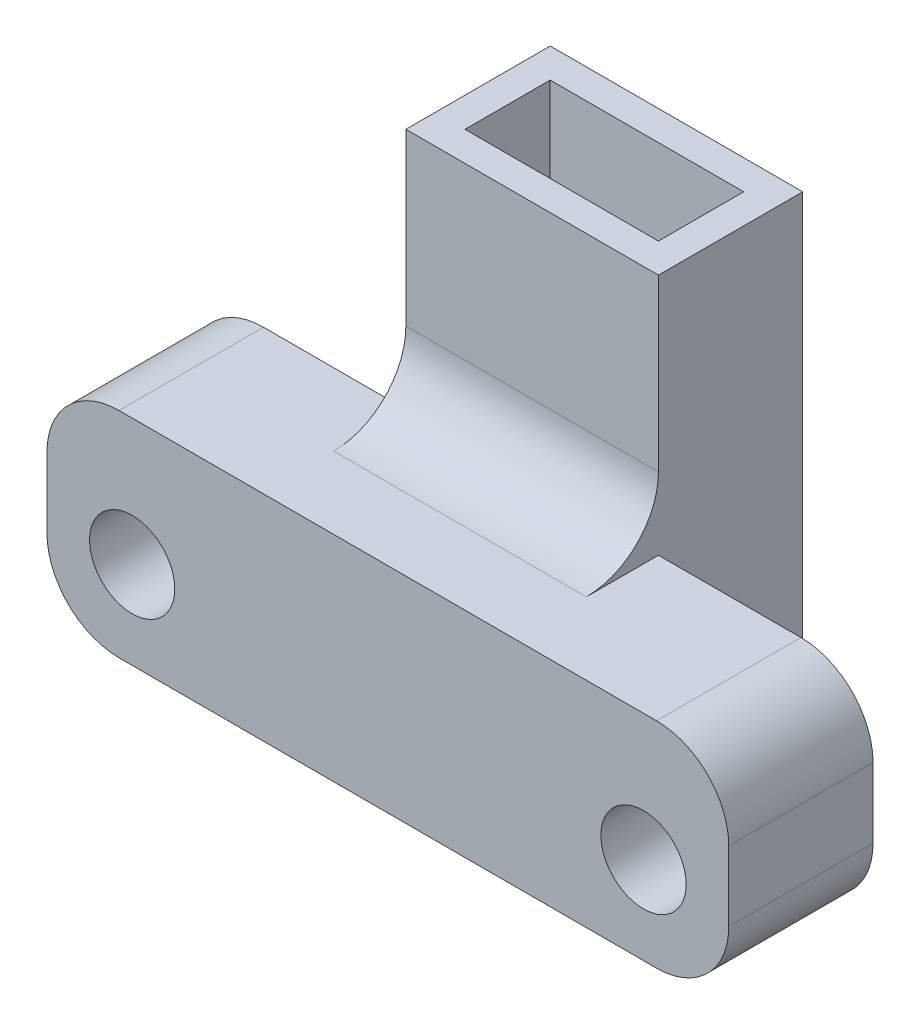
ISO-10303-21;
HEADER;
FILE_DESCRIPTION(('STEP AP214'),'2;1');
FILE_NAME('part.step','',(''),(''),'','','');
FILE_SCHEMA(('AUTOMOTIVE_DESIGN { 1 0 10303 214 1 1 1 1 }'));
ENDSEC;
DATA;
#1=APPLICATION_CONTEXT('core data for automotive mechanical design processes');
#2=APPLICATION_PROTOCOL_DEFINITION('international standard','automotive_design',2000,#1);
#3=PRODUCT_CONTEXT('',#1,'mechanical');
#4=PRODUCT('Part','Part','',(#3));
#5=PRODUCT_RELATED_PRODUCT_CATEGORY('part','',(#4));
#6=PRODUCT_DEFINITION_FORMATION('','',#4);
#7=PRODUCT_DEFINITION_CONTEXT('part definition',#1,'design');
#8=PRODUCT_DEFINITION('design','',#6,#7);
#9=PRODUCT_DEFINITION_SHAPE('','',#8);
#10=(LENGTH_UNIT() NAMED_UNIT(*) SI_UNIT(.MILLI.,.METRE.));
#11=(NAMED_UNIT(*) PLANE_ANGLE_UNIT() SI_UNIT($,.RADIAN.));
#12=(NAMED_UNIT(*) SI_UNIT($,.STERADIAN.) SOLID_ANGLE_UNIT());
#13=UNCERTAINTY_MEASURE_WITH_UNIT(LENGTH_MEASURE(1.E-05),#10,'distance_accuracy_value','');
#14=(GEOMETRIC_REPRESENTATION_CONTEXT(3) GLOBAL_UNCERTAINTY_ASSIGNED_CONTEXT((#13)) GLOBAL_UNIT_ASSIGNED_CONTEXT((#10,
#11,#12)) REPRESENTATION_CONTEXT('',''));
#15=CARTESIAN_POINT('',(0.,0.,0.));
#16=DIRECTION('',(0.,0.,1.));
#17=DIRECTION('',(1.,0.,0.));
#18=AXIS2_PLACEMENT_3D('',#15,#16,#17);
#19=CARTESIAN_POINT('',(-4.445,16.08,2.54));
#20=DIRECTION('',(0.,0.,-1.));
#21=DIRECTION('',(-1.,0.,0.));
#22=AXIS2_PLACEMENT_3D('',#19,#20,#21);
#23=PLANE('',#22);
#24=DIRECTION('',(0.,-1.,0.));
#25=VECTOR('',#24,1.);
#26=CARTESIAN_POINT('',(-4.445,16.08,2.54));
#27=LINE('',#26,#25);
#28=CARTESIAN_POINT('',(-4.445,16.08,2.54));
#29=VERTEX_POINT('',#28);
#30=CARTESIAN_POINT('',(-4.445,10.0805167244017,2.54));
#31=VERTEX_POINT('',#30);
#32=EDGE_CURVE('E282',#29,#31,#27,.T.);
#33=ORIENTED_EDGE('',*,*,#32,.T.);
#34=DIRECTION('',(-1.,0.,0.));
#35=VECTOR('',#34,1.);
#36=CARTESIAN_POINT('',(4.445,10.0805167244017,2.54));
#37=LINE('',#36,#35);
#38=CARTESIAN_POINT('',(4.445,10.0805167244017,2.54));
#39=VERTEX_POINT('',#38);
#40=EDGE_CURVE('E274',#31,#39,#37,.F.);
#41=ORIENTED_EDGE('',*,*,#40,.T.);
#42=DIRECTION('',(0.,-1.,0.));
#43=VECTOR('',#42,1.);
#44=CARTESIAN_POINT('',(4.445,16.08,2.54));
#45=LINE('',#44,#43);
#46=CARTESIAN_POINT('',(4.445,16.08,2.54));
#47=VERTEX_POINT('',#46);
#48=EDGE_CURVE('E280',#47,#39,#45,.T.);
#49=ORIENTED_EDGE('',*,*,#48,.F.);
#50=DIRECTION('',(1.,0.,0.));
#51=VECTOR('',#50,1.);
#52=CARTESIAN_POINT('',(-4.445,16.08,2.54));
#53=LINE('',#52,#51);
#54=EDGE_CURVE('E309',#29,#47,#53,.T.);
#55=ORIENTED_EDGE('',*,*,#54,.F.);
#56=EDGE_LOOP('',(#33,#41,#49,#55));
#57=FACE_BOUND('',#56,.T.);
#58=ADVANCED_FACE('F33',(#57),#23,.F.);
#59=CARTESIAN_POINT('',(4.445,16.08,2.54));
#60=DIRECTION('',(-1.,0.,0.));
#61=DIRECTION('',(0.,0.,1.));
#62=AXIS2_PLACEMENT_3D('',#59,#60,#61);
#63=PLANE('',#62);
#64=DIRECTION('',(0.,0.,-1.));
#65=VECTOR('',#64,1.);
#66=CARTESIAN_POINT('',(4.445,0.,2.54));
#67=LINE('',#66,#65);
#68=CARTESIAN_POINT('',(4.445,0.,2.54));
#69=VERTEX_POINT('',#68);
#70=CARTESIAN_POINT('',(4.445,0.,-2.54));
#71=VERTEX_POINT('',#70);
#72=EDGE_CURVE('E222',#69,#71,#67,.T.);
#73=ORIENTED_EDGE('',*,*,#72,.T.);
#74=DIRECTION('',(0.,-1.,0.));
#75=VECTOR('',#74,1.);
#76=CARTESIAN_POINT('',(4.445,16.08,-2.54));
#77=LINE('',#76,#75);
#78=CARTESIAN_POINT('',(4.445,16.08,-2.54));
#79=VERTEX_POINT('',#78);
#80=EDGE_CURVE('E315',#79,#71,#77,.T.);
#81=ORIENTED_EDGE('',*,*,#80,.F.);
#82=DIRECTION('',(0.,0.,-1.));
#83=VECTOR('',#82,1.);
#84=CARTESIAN_POINT('',(4.445,16.08,2.54));
#85=LINE('',#84,#83);
#86=EDGE_CURVE('E289',#47,#79,#85,.T.);
#87=ORIENTED_EDGE('',*,*,#86,.F.);
#88=ORIENTED_EDGE('',*,*,#48,.T.);
#89=CARTESIAN_POINT('',(4.445,10.0805167244017,5.08));
#90=DIRECTION('',(-1.,0.,0.));
#91=DIRECTION('',(0.,0.,1.));
#92=AXIS2_PLACEMENT_3D('',#89,#90,#91);
#93=CIRCLE('',#92,2.54);
#94=CARTESIAN_POINT('',(4.445,7.54051672440169,5.08));
#95=VERTEX_POINT('',#94);
#96=EDGE_CURVE('E11',#39,#95,#93,.T.);
#97=ORIENTED_EDGE('',*,*,#96,.T.);
#98=DIRECTION('',(0.,0.,1.));
#99=VECTOR('',#98,1.);
#100=CARTESIAN_POINT('',(4.445,7.54051672440169,2.54));
#101=LINE('',#100,#99);
#102=CARTESIAN_POINT('',(4.445,7.54051672440169,2.54));
#103=VERTEX_POINT('',#102);
#104=EDGE_CURVE('E47',#103,#95,#101,.T.);
#105=ORIENTED_EDGE('',*,*,#104,.F.);
#106=EDGE_CURVE('E291',#103,#69,#45,.T.);
#107=ORIENTED_EDGE('',*,*,#106,.T.);
#108=EDGE_LOOP('',(#73,#81,#87,#88,#97,#105,#107));
#109=FACE_BOUND('',#108,.T.);
#110=ADVANCED_FACE('F286',(#109),#63,.F.);
#111=CARTESIAN_POINT('',(-4.445,16.08,-2.54));
#112=DIRECTION('',(0.,0.,1.));
#113=DIRECTION('',(1.,0.,0.));
#114=AXIS2_PLACEMENT_3D('',#111,#112,#113);
#115=PLANE('',#114);
#116=DIRECTION('',(-1.,0.,0.));
#117=VECTOR('',#116,1.);
#118=CARTESIAN_POINT('',(-4.445,0.,-2.54));
#119=LINE('',#118,#117);
#120=CARTESIAN_POINT('',(-4.445,0.,-2.54));
#121=VERTEX_POINT('',#120);
#122=EDGE_CURVE('E321',#71,#121,#119,.T.);
#123=ORIENTED_EDGE('',*,*,#122,.T.);
#124=DIRECTION('',(0.,-1.,0.));
#125=VECTOR('',#124,1.);
#126=CARTESIAN_POINT('',(-4.445,16.08,-2.54));
#127=LINE('',#126,#125);
#128=CARTESIAN_POINT('',(-4.445,16.08,-2.54));
#129=VERTEX_POINT('',#128);
#130=EDGE_CURVE('E323',#129,#121,#127,.T.);
#131=ORIENTED_EDGE('',*,*,#130,.F.);
#132=DIRECTION('',(-1.,0.,0.));
#133=VECTOR('',#132,1.);
#134=CARTESIAN_POINT('',(-4.445,16.08,-2.54));
#135=LINE('',#134,#133);
#136=EDGE_CURVE('E390',#79,#129,#135,.T.);
#137=ORIENTED_EDGE('',*,*,#136,.F.);
#138=ORIENTED_EDGE('',*,*,#80,.T.);
#139=EDGE_LOOP('',(#123,#131,#137,#138));
#140=FACE_BOUND('',#139,.T.);
#141=ADVANCED_FACE('F389',(#140),#115,.F.);
#142=CARTESIAN_POINT('',(-4.445,16.08,2.54));
#143=DIRECTION('',(1.,0.,0.));
#144=DIRECTION('',(0.,0.,-1.));
#145=AXIS2_PLACEMENT_3D('',#142,#143,#144);
#146=PLANE('',#145);
#147=DIRECTION('',(0.,0.,1.));
#148=VECTOR('',#147,1.);
#149=CARTESIAN_POINT('',(-4.445,0.,2.54));
#150=LINE('',#149,#148);
#151=CARTESIAN_POINT('',(-4.445,0.,2.54));
#152=VERTEX_POINT('',#151);
#153=EDGE_CURVE('E328',#121,#152,#150,.T.);
#154=ORIENTED_EDGE('',*,*,#153,.T.);
#155=CARTESIAN_POINT('',(-4.445,7.54051672440169,2.54));
#156=VERTEX_POINT('',#155);
#157=EDGE_CURVE('E290',#156,#152,#27,.T.);
#158=ORIENTED_EDGE('',*,*,#157,.F.);
#159=DIRECTION('',(0.,0.,-1.));
#160=VECTOR('',#159,1.);
#161=CARTESIAN_POINT('',(-4.445,7.54051672440169,2.54));
#162=LINE('',#161,#160);
#163=CARTESIAN_POINT('',(-4.445,7.54051672440169,5.08));
#164=VERTEX_POINT('',#163);
#165=EDGE_CURVE('E272',#164,#156,#162,.T.);
#166=ORIENTED_EDGE('',*,*,#165,.F.);
#167=CARTESIAN_POINT('',(-4.445,10.0805167244017,5.08));
#168=DIRECTION('',(1.,0.,0.));
#169=DIRECTION('',(0.,0.,-1.));
#170=AXIS2_PLACEMENT_3D('',#167,#168,#169);
#171=CIRCLE('',#170,2.54);
#172=EDGE_CURVE('E41',#164,#31,#171,.T.);
#173=ORIENTED_EDGE('',*,*,#172,.T.);
#174=ORIENTED_EDGE('',*,*,#32,.F.);
#175=DIRECTION('',(0.,0.,1.));
#176=VECTOR('',#175,1.);
#177=CARTESIAN_POINT('',(-4.445,16.08,2.54));
#178=LINE('',#177,#176);
#179=EDGE_CURVE('E311',#129,#29,#178,.T.);
#180=ORIENTED_EDGE('',*,*,#179,.F.);
#181=ORIENTED_EDGE('',*,*,#130,.T.);
#182=EDGE_LOOP('',(#154,#158,#166,#173,#174,#180,#181));
#183=FACE_BOUND('',#182,.T.);
#184=ADVANCED_FACE('F383',(#183),#146,.F.);
#185=CARTESIAN_POINT('',(0.,16.08,0.));
#186=DIRECTION('',(0.,-1.,0.));
#187=DIRECTION('',(0.,0.,-1.));
#188=AXIS2_PLACEMENT_3D('',#185,#186,#187);
#189=PLANE('',#188);
#190=DIRECTION('',(0.,0.,-1.));
#191=VECTOR('',#190,1.);
#192=CARTESIAN_POINT('',(3.405,16.08,1.5));
#193=LINE('',#192,#191);
#194=CARTESIAN_POINT('',(3.405,16.08,1.5));
#195=VERTEX_POINT('',#194);
#196=CARTESIAN_POINT('',(3.405,16.08,-1.5));
#197=VERTEX_POINT('',#196);
#198=EDGE_CURVE('E179',#195,#197,#193,.T.);
#199=ORIENTED_EDGE('',*,*,#198,.F.);
#200=DIRECTION('',(1.,0.,0.));
#201=VECTOR('',#200,1.);
#202=CARTESIAN_POINT('',(-3.405,16.08,1.5));
#203=LINE('',#202,#201);
#204=CARTESIAN_POINT('',(-3.405,16.08,1.5));
#205=VERTEX_POINT('',#204);
#206=EDGE_CURVE('E184',#205,#195,#203,.T.);
#207=ORIENTED_EDGE('',*,*,#206,.F.);
#208=DIRECTION('',(0.,0.,-1.));
#209=VECTOR('',#208,1.);
#210=CARTESIAN_POINT('',(-3.405,16.08,1.5));
#211=LINE('',#210,#209);
#212=CARTESIAN_POINT('',(-3.405,16.08,-1.5));
#213=VERTEX_POINT('',#212);
#214=EDGE_CURVE('E189',#205,#213,#211,.T.);
#215=ORIENTED_EDGE('',*,*,#214,.T.);
#216=DIRECTION('',(1.,0.,0.));
#217=VECTOR('',#216,1.);
#218=CARTESIAN_POINT('',(-3.405,16.08,-1.5));
#219=LINE('',#218,#217);
#220=EDGE_CURVE('E168',#213,#197,#219,.T.);
#221=ORIENTED_EDGE('',*,*,#220,.T.);
#222=EDGE_LOOP('',(#199,#207,#215,#221));
#223=FACE_BOUND('',#222,.T.);
#224=ORIENTED_EDGE('',*,*,#86,.T.);
#225=ORIENTED_EDGE('',*,*,#136,.T.);
#226=ORIENTED_EDGE('',*,*,#179,.T.);
#227=ORIENTED_EDGE('',*,*,#54,.T.);
#228=EDGE_LOOP('',(#224,#225,#226,#227));
#229=FACE_BOUND('',#228,.T.);
#230=ADVANCED_FACE('F186',(#223,#229),#189,.F.);
#231=CARTESIAN_POINT('',(0.,0.,0.));
#232=DIRECTION('',(0.,-1.,0.));
#233=DIRECTION('',(0.,0.,-1.));
#234=AXIS2_PLACEMENT_3D('',#231,#232,#233);
#235=PLANE('',#234);
#236=DIRECTION('',(-1.,0.,0.));
#237=VECTOR('',#236,1.);
#238=CARTESIAN_POINT('',(0.,0.,1.5));
#239=LINE('',#238,#237);
#240=CARTESIAN_POINT('',(3.405,0.,1.5));
#241=VERTEX_POINT('',#240);
#242=CARTESIAN_POINT('',(-3.405,0.,1.5));
#243=VERTEX_POINT('',#242);
#244=EDGE_CURVE('E341',#241,#243,#239,.T.);
#245=ORIENTED_EDGE('',*,*,#244,.F.);
#246=DIRECTION('',(0.,0.,1.));
#247=VECTOR('',#246,1.);
#248=CARTESIAN_POINT('',(3.405,0.,0.));
#249=LINE('',#248,#247);
#250=CARTESIAN_POINT('',(3.405,0.,-1.5));
#251=VERTEX_POINT('',#250);
#252=EDGE_CURVE('E335',#251,#241,#249,.T.);
#253=ORIENTED_EDGE('',*,*,#252,.F.);
#254=DIRECTION('',(-1.,0.,0.));
#255=VECTOR('',#254,1.);
#256=CARTESIAN_POINT('',(0.,0.,-1.5));
#257=LINE('',#256,#255);
#258=CARTESIAN_POINT('',(-3.405,0.,-1.5));
#259=VERTEX_POINT('',#258);
#260=EDGE_CURVE('E171',#251,#259,#257,.T.);
#261=ORIENTED_EDGE('',*,*,#260,.T.);
#262=DIRECTION('',(0.,0.,1.));
#263=VECTOR('',#262,1.);
#264=CARTESIAN_POINT('',(-3.405,0.,0.));
#265=LINE('',#264,#263);
#266=EDGE_CURVE('E338',#259,#243,#265,.T.);
#267=ORIENTED_EDGE('',*,*,#266,.T.);
#268=EDGE_LOOP('',(#245,#253,#261,#267));
#269=FACE_BOUND('',#268,.T.);
#270=DIRECTION('',(1.,0.,0.));
#271=VECTOR('',#270,1.);
#272=CARTESIAN_POINT('',(-12.,0.,2.54));
#273=LINE('',#272,#271);
#274=CARTESIAN_POINT('',(9.46,0.,2.54));
#275=VERTEX_POINT('',#274);
#276=EDGE_CURVE('E231',#69,#275,#273,.T.);
#277=ORIENTED_EDGE('',*,*,#276,.T.);
#278=DIRECTION('',(0.,0.,-1.));
#279=VECTOR('',#278,1.);
#280=CARTESIAN_POINT('',(9.46,0.,7.62));
#281=LINE('',#280,#279);
#282=CARTESIAN_POINT('',(9.46,0.,7.62));
#283=VERTEX_POINT('',#282);
#284=EDGE_CURVE('E244',#275,#283,#281,.F.);
#285=ORIENTED_EDGE('',*,*,#284,.T.);
#286=DIRECTION('',(1.,0.,0.));
#287=VECTOR('',#286,1.);
#288=CARTESIAN_POINT('',(-12.,0.,7.62));
#289=LINE('',#288,#287);
#290=CARTESIAN_POINT('',(-9.46,0.,7.62));
#291=VERTEX_POINT('',#290);
#292=EDGE_CURVE('E219',#291,#283,#289,.T.);
#293=ORIENTED_EDGE('',*,*,#292,.F.);
#294=DIRECTION('',(0.,0.,-1.));
#295=VECTOR('',#294,1.);
#296=CARTESIAN_POINT('',(-9.46,0.,2.54));
#297=LINE('',#296,#295);
#298=CARTESIAN_POINT('',(-9.46,0.,2.54));
#299=VERTEX_POINT('',#298);
#300=EDGE_CURVE('E241',#291,#299,#297,.T.);
#301=ORIENTED_EDGE('',*,*,#300,.T.);
#302=EDGE_CURVE('E213',#299,#152,#273,.T.);
#303=ORIENTED_EDGE('',*,*,#302,.T.);
#304=ORIENTED_EDGE('',*,*,#153,.F.);
#305=ORIENTED_EDGE('',*,*,#122,.F.);
#306=ORIENTED_EDGE('',*,*,#72,.F.);
#307=EDGE_LOOP('',(#277,#285,#293,#301,#303,#304,#305,#306));
#308=FACE_BOUND('',#307,.T.);
#309=ADVANCED_FACE('F352',(#269,#308),#235,.T.);
#310=CARTESIAN_POINT('',(0.,0.,2.54));
#311=DIRECTION('',(0.,0.,1.));
#312=DIRECTION('',(1.,0.,0.));
#313=AXIS2_PLACEMENT_3D('',#310,#311,#312);
#314=PLANE('',#313);
#315=CARTESIAN_POINT('',(-9.,3.07594,2.54));
#316=DIRECTION('',(0.,0.,1.));
#317=DIRECTION('',(1.,0.,0.));
#318=AXIS2_PLACEMENT_3D('',#315,#316,#317);
#319=CIRCLE('',#318,1.5);
#320=CARTESIAN_POINT('',(-7.5,3.07594,2.54));
#321=VERTEX_POINT('',#320);
#322=EDGE_CURVE('E205',#321,#321,#319,.T.);
#323=ORIENTED_EDGE('',*,*,#322,.T.);
#324=EDGE_LOOP('',(#323));
#325=FACE_BOUND('',#324,.T.);
#326=ORIENTED_EDGE('',*,*,#302,.F.);
#327=CARTESIAN_POINT('',(-9.46,2.54,2.54));
#328=DIRECTION('',(0.,0.,1.));
#329=DIRECTION('',(1.,0.,0.));
#330=AXIS2_PLACEMENT_3D('',#327,#328,#329);
#331=CIRCLE('',#330,2.54);
#332=CARTESIAN_POINT('',(-12.,2.54,2.54));
#333=VERTEX_POINT('',#332);
#334=EDGE_CURVE('E256',#299,#333,#331,.F.);
#335=ORIENTED_EDGE('',*,*,#334,.T.);
#336=DIRECTION('',(0.,-1.,0.));
#337=VECTOR('',#336,1.);
#338=CARTESIAN_POINT('',(-12.,7.54051672440169,2.54));
#339=LINE('',#338,#337);
#340=CARTESIAN_POINT('',(-12.,5.00051672440169,2.54));
#341=VERTEX_POINT('',#340);
#342=EDGE_CURVE('E228',#341,#333,#339,.T.);
#343=ORIENTED_EDGE('',*,*,#342,.F.);
#344=CARTESIAN_POINT('',(-9.46,5.00051672440169,2.54));
#345=DIRECTION('',(0.,0.,1.));
#346=DIRECTION('',(1.,0.,0.));
#347=AXIS2_PLACEMENT_3D('',#344,#345,#346);
#348=CIRCLE('',#347,2.54);
#349=CARTESIAN_POINT('',(-9.46,7.54051672440169,2.54));
#350=VERTEX_POINT('',#349);
#351=EDGE_CURVE('E254',#341,#350,#348,.F.);
#352=ORIENTED_EDGE('',*,*,#351,.T.);
#353=DIRECTION('',(-1.,0.,0.));
#354=VECTOR('',#353,1.);
#355=CARTESIAN_POINT('',(-12.,7.54051672440169,2.54));
#356=LINE('',#355,#354);
#357=EDGE_CURVE('E225',#156,#350,#356,.T.);
#358=ORIENTED_EDGE('',*,*,#357,.F.);
#359=ORIENTED_EDGE('',*,*,#157,.T.);
#360=EDGE_LOOP('',(#326,#335,#343,#352,#358,#359));
#361=FACE_BOUND('',#360,.T.);
#362=ADVANCED_FACE('F382',(#325,#361),#314,.F.);
#363=CARTESIAN_POINT('',(12.,7.54051672440169,7.62));
#364=DIRECTION('',(-1.,0.,0.));
#365=DIRECTION('',(0.,-1.,0.));
#366=AXIS2_PLACEMENT_3D('',#363,#364,#365);
#367=PLANE('',#366);
#368=DIRECTION('',(0.,1.,0.));
#369=VECTOR('',#368,1.);
#370=CARTESIAN_POINT('',(12.,7.54051672440169,7.62));
#371=LINE('',#370,#369);
#372=CARTESIAN_POINT('',(12.,2.54,7.62));
#373=VERTEX_POINT('',#372);
#374=CARTESIAN_POINT('',(12.,5.00051672440169,7.62));
#375=VERTEX_POINT('',#374);
#376=EDGE_CURVE('E209',#373,#375,#371,.T.);
#377=ORIENTED_EDGE('',*,*,#376,.F.);
#378=DIRECTION('',(0.,0.,-1.));
#379=VECTOR('',#378,1.);
#380=CARTESIAN_POINT('',(12.,2.54,2.54));
#381=LINE('',#380,#379);
#382=CARTESIAN_POINT('',(12.,2.54,2.54));
#383=VERTEX_POINT('',#382);
#384=EDGE_CURVE('E345',#373,#383,#381,.T.);
#385=ORIENTED_EDGE('',*,*,#384,.T.);
#386=DIRECTION('',(0.,1.,0.));
#387=VECTOR('',#386,1.);
#388=CARTESIAN_POINT('',(12.,7.54051672440169,2.54));
#389=LINE('',#388,#387);
#390=CARTESIAN_POINT('',(12.,5.00051672440169,2.54));
#391=VERTEX_POINT('',#390);
#392=EDGE_CURVE('E208',#383,#391,#389,.T.);
#393=ORIENTED_EDGE('',*,*,#392,.T.);
#394=DIRECTION('',(0.,0.,-1.));
#395=VECTOR('',#394,1.);
#396=CARTESIAN_POINT('',(12.,5.00051672440169,7.62));
#397=LINE('',#396,#395);
#398=EDGE_CURVE('E343',#391,#375,#397,.F.);
#399=ORIENTED_EDGE('',*,*,#398,.T.);
#400=EDGE_LOOP('',(#377,#385,#393,#399));
#401=FACE_BOUND('',#400,.T.);
#402=ADVANCED_FACE('F361',(#401),#367,.F.);
#403=CARTESIAN_POINT('',(-12.,7.54051672440169,7.62));
#404=DIRECTION('',(0.,-1.,0.));
#405=DIRECTION('',(0.,0.,-1.));
#406=AXIS2_PLACEMENT_3D('',#403,#404,#405);
#407=PLANE('',#406);
#408=DIRECTION('',(-1.,0.,0.));
#409=VECTOR('',#408,1.);
#410=CARTESIAN_POINT('',(-4.445,7.54051672440169,5.08));
#411=LINE('',#410,#409);
#412=EDGE_CURVE('E269',#95,#164,#411,.T.);
#413=ORIENTED_EDGE('',*,*,#412,.T.);
#414=ORIENTED_EDGE('',*,*,#165,.T.);
#415=ORIENTED_EDGE('',*,*,#357,.T.);
#416=DIRECTION('',(0.,0.,-1.));
#417=VECTOR('',#416,1.);
#418=CARTESIAN_POINT('',(-9.46,7.54051672440169,7.62));
#419=LINE('',#418,#417);
#420=CARTESIAN_POINT('',(-9.46,7.54051672440169,7.62));
#421=VERTEX_POINT('',#420);
#422=EDGE_CURVE('E263',#350,#421,#419,.F.);
#423=ORIENTED_EDGE('',*,*,#422,.T.);
#424=DIRECTION('',(-1.,0.,0.));
#425=VECTOR('',#424,1.);
#426=CARTESIAN_POINT('',(-12.,7.54051672440169,7.62));
#427=LINE('',#426,#425);
#428=CARTESIAN_POINT('',(9.46,7.54051672440169,7.62));
#429=VERTEX_POINT('',#428);
#430=EDGE_CURVE('E212',#429,#421,#427,.T.);
#431=ORIENTED_EDGE('',*,*,#430,.F.);
#432=DIRECTION('',(0.,0.,-1.));
#433=VECTOR('',#432,1.);
#434=CARTESIAN_POINT('',(9.46,7.54051672440169,7.62));
#435=LINE('',#434,#433);
#436=CARTESIAN_POINT('',(9.46,7.54051672440169,2.54));
#437=VERTEX_POINT('',#436);
#438=EDGE_CURVE('E265',#429,#437,#435,.T.);
#439=ORIENTED_EDGE('',*,*,#438,.T.);
#440=EDGE_CURVE('E226',#437,#103,#356,.T.);
#441=ORIENTED_EDGE('',*,*,#440,.T.);
#442=ORIENTED_EDGE('',*,*,#104,.T.);
#443=EDGE_LOOP('',(#413,#414,#415,#423,#431,#439,#441,#442));
#444=FACE_BOUND('',#443,.T.);
#445=ADVANCED_FACE('F296',(#444),#407,.F.);
#446=CARTESIAN_POINT('',(-12.,7.54051672440169,7.62));
#447=DIRECTION('',(1.,0.,0.));
#448=DIRECTION('',(0.,1.,0.));
#449=AXIS2_PLACEMENT_3D('',#446,#447,#448);
#450=PLANE('',#449);
#451=ORIENTED_EDGE('',*,*,#342,.T.);
#452=DIRECTION('',(0.,0.,-1.));
#453=VECTOR('',#452,1.);
#454=CARTESIAN_POINT('',(-12.,2.54,7.62));
#455=LINE('',#454,#453);
#456=CARTESIAN_POINT('',(-12.,2.54,7.62));
#457=VERTEX_POINT('',#456);
#458=EDGE_CURVE('E261',#333,#457,#455,.F.);
#459=ORIENTED_EDGE('',*,*,#458,.T.);
#460=DIRECTION('',(0.,-1.,0.));
#461=VECTOR('',#460,1.);
#462=CARTESIAN_POINT('',(-12.,7.54051672440169,7.62));
#463=LINE('',#462,#461);
#464=CARTESIAN_POINT('',(-12.,5.00051672440169,7.62));
#465=VERTEX_POINT('',#464);
#466=EDGE_CURVE('E216',#465,#457,#463,.T.);
#467=ORIENTED_EDGE('',*,*,#466,.F.);
#468=DIRECTION('',(0.,0.,-1.));
#469=VECTOR('',#468,1.);
#470=CARTESIAN_POINT('',(-12.,5.00051672440169,7.62));
#471=LINE('',#470,#469);
#472=EDGE_CURVE('E258',#465,#341,#471,.T.);
#473=ORIENTED_EDGE('',*,*,#472,.T.);
#474=EDGE_LOOP('',(#451,#459,#467,#473));
#475=FACE_BOUND('',#474,.T.);
#476=ADVANCED_FACE('F373',(#475),#450,.F.);
#477=CARTESIAN_POINT('',(0.,0.,7.62));
#478=DIRECTION('',(0.,0.,1.));
#479=DIRECTION('',(1.,0.,0.));
#480=AXIS2_PLACEMENT_3D('',#477,#478,#479);
#481=PLANE('',#480);
#482=CARTESIAN_POINT('',(9.,3.07594,7.62));
#483=DIRECTION('',(0.,0.,1.));
#484=DIRECTION('',(1.,0.,0.));
#485=AXIS2_PLACEMENT_3D('',#482,#483,#484);
#486=CIRCLE('',#485,1.5);
#487=CARTESIAN_POINT('',(10.5,3.07594,7.62));
#488=VERTEX_POINT('',#487);
#489=EDGE_CURVE('E196',#488,#488,#486,.T.);
#490=ORIENTED_EDGE('',*,*,#489,.F.);
#491=EDGE_LOOP('',(#490));
#492=FACE_BOUND('',#491,.T.);
#493=CARTESIAN_POINT('',(-9.,3.07594,7.62));
#494=DIRECTION('',(0.,0.,1.));
#495=DIRECTION('',(1.,0.,0.));
#496=AXIS2_PLACEMENT_3D('',#493,#494,#495);
#497=CIRCLE('',#496,1.5);
#498=CARTESIAN_POINT('',(-7.5,3.07594,7.62));
#499=VERTEX_POINT('',#498);
#500=EDGE_CURVE('E202',#499,#499,#497,.T.);
#501=ORIENTED_EDGE('',*,*,#500,.F.);
#502=EDGE_LOOP('',(#501));
#503=FACE_BOUND('',#502,.T.);
#504=ORIENTED_EDGE('',*,*,#292,.T.);
#505=CARTESIAN_POINT('',(9.46,2.54,7.62));
#506=DIRECTION('',(0.,0.,1.));
#507=DIRECTION('',(1.,0.,0.));
#508=AXIS2_PLACEMENT_3D('',#505,#506,#507);
#509=CIRCLE('',#508,2.54);
#510=EDGE_CURVE('E252',#283,#373,#509,.T.);
#511=ORIENTED_EDGE('',*,*,#510,.T.);
#512=ORIENTED_EDGE('',*,*,#376,.T.);
#513=CARTESIAN_POINT('',(9.46,5.00051672440169,7.62));
#514=DIRECTION('',(0.,0.,1.));
#515=DIRECTION('',(1.,0.,0.));
#516=AXIS2_PLACEMENT_3D('',#513,#514,#515);
#517=CIRCLE('',#516,2.54);
#518=EDGE_CURVE('E248',#375,#429,#517,.T.);
#519=ORIENTED_EDGE('',*,*,#518,.T.);
#520=ORIENTED_EDGE('',*,*,#430,.T.);
#521=CARTESIAN_POINT('',(-9.46,5.00051672440169,7.62));
#522=DIRECTION('',(0.,0.,1.));
#523=DIRECTION('',(1.,0.,0.));
#524=AXIS2_PLACEMENT_3D('',#521,#522,#523);
#525=CIRCLE('',#524,2.54);
#526=EDGE_CURVE('E246',#421,#465,#525,.T.);
#527=ORIENTED_EDGE('',*,*,#526,.T.);
#528=ORIENTED_EDGE('',*,*,#466,.T.);
#529=CARTESIAN_POINT('',(-9.46,2.54,7.62));
#530=DIRECTION('',(0.,0.,1.));
#531=DIRECTION('',(1.,0.,0.));
#532=AXIS2_PLACEMENT_3D('',#529,#530,#531);
#533=CIRCLE('',#532,2.54);
#534=EDGE_CURVE('E250',#457,#291,#533,.T.);
#535=ORIENTED_EDGE('',*,*,#534,.T.);
#536=EDGE_LOOP('',(#504,#511,#512,#519,#520,#527,#528,#535));
#537=FACE_BOUND('',#536,.T.);
#538=ADVANCED_FACE('F358',(#492,#503,#537),#481,.T.);
#539=CARTESIAN_POINT('',(9.,3.07594,2.54));
#540=DIRECTION('',(0.,0.,1.));
#541=DIRECTION('',(1.,0.,0.));
#542=AXIS2_PLACEMENT_3D('',#539,#540,#541);
#543=CIRCLE('',#542,1.5);
#544=CARTESIAN_POINT('',(10.5,3.07594,2.54));
#545=VERTEX_POINT('',#544);
#546=EDGE_CURVE('E201',#545,#545,#543,.T.);
#547=ORIENTED_EDGE('',*,*,#546,.T.);
#548=EDGE_LOOP('',(#547));
#549=FACE_BOUND('',#548,.T.);
#550=ORIENTED_EDGE('',*,*,#392,.F.);
#551=CARTESIAN_POINT('',(9.46,2.54,2.54));
#552=DIRECTION('',(0.,0.,1.));
#553=DIRECTION('',(1.,0.,0.));
#554=AXIS2_PLACEMENT_3D('',#551,#552,#553);
#555=CIRCLE('',#554,2.54);
#556=EDGE_CURVE('E239',#383,#275,#555,.F.);
#557=ORIENTED_EDGE('',*,*,#556,.T.);
#558=ORIENTED_EDGE('',*,*,#276,.F.);
#559=ORIENTED_EDGE('',*,*,#106,.F.);
#560=ORIENTED_EDGE('',*,*,#440,.F.);
#561=CARTESIAN_POINT('',(9.46,5.00051672440169,2.54));
#562=DIRECTION('',(0.,0.,1.));
#563=DIRECTION('',(1.,0.,0.));
#564=AXIS2_PLACEMENT_3D('',#561,#562,#563);
#565=CIRCLE('',#564,2.54);
#566=EDGE_CURVE('E347',#437,#391,#565,.F.);
#567=ORIENTED_EDGE('',*,*,#566,.T.);
#568=EDGE_LOOP('',(#550,#557,#558,#559,#560,#567));
#569=FACE_BOUND('',#568,.T.);
#570=ADVANCED_FACE('F306',(#549,#569),#314,.F.);
#571=CARTESIAN_POINT('',(-9.,3.07594,-2.540025));
#572=DIRECTION('',(0.,0.,1.));
#573=DIRECTION('',(1.,0.,0.));
#574=AXIS2_PLACEMENT_3D('',#571,#572,#573);
#575=CYLINDRICAL_SURFACE('',#574,1.5);
#576=ORIENTED_EDGE('',*,*,#500,.T.);
#577=EDGE_LOOP('',(#576));
#578=FACE_BOUND('',#577,.T.);
#579=ORIENTED_EDGE('',*,*,#322,.F.);
#580=EDGE_LOOP('',(#579));
#581=FACE_BOUND('',#580,.T.);
#582=ADVANCED_FACE('F456',(#578,#581),#575,.F.);
#583=CARTESIAN_POINT('',(9.,3.07594,-2.540025));
#584=DIRECTION('',(0.,0.,1.));
#585=DIRECTION('',(1.,0.,0.));
#586=AXIS2_PLACEMENT_3D('',#583,#584,#585);
#587=CYLINDRICAL_SURFACE('',#586,1.5);
#588=ORIENTED_EDGE('',*,*,#489,.T.);
#589=EDGE_LOOP('',(#588));
#590=FACE_BOUND('',#589,.T.);
#591=ORIENTED_EDGE('',*,*,#546,.F.);
#592=EDGE_LOOP('',(#591));
#593=FACE_BOUND('',#592,.T.);
#594=ADVANCED_FACE('F557',(#590,#593),#587,.F.);
#595=CARTESIAN_POINT('',(-3.405,-5.00000000014378E-05,1.5));
#596=DIRECTION('',(0.,0.,1.));
#597=DIRECTION('',(1.,0.,0.));
#598=AXIS2_PLACEMENT_3D('',#595,#596,#597);
#599=PLANE('',#598);
#600=ORIENTED_EDGE('',*,*,#244,.T.);
#601=DIRECTION('',(0.,1.,0.));
#602=VECTOR('',#601,1.);
#603=CARTESIAN_POINT('',(-3.405,-5.00000000014378E-05,1.5));
#604=LINE('',#603,#602);
#605=EDGE_CURVE('E194',#243,#205,#604,.T.);
#606=ORIENTED_EDGE('',*,*,#605,.T.);
#607=ORIENTED_EDGE('',*,*,#206,.T.);
#608=DIRECTION('',(0.,1.,0.));
#609=VECTOR('',#608,1.);
#610=CARTESIAN_POINT('',(3.405,-5.00000000014378E-05,1.5));
#611=LINE('',#610,#609);
#612=EDGE_CURVE('E175',#241,#195,#611,.T.);
#613=ORIENTED_EDGE('',*,*,#612,.F.);
#614=EDGE_LOOP('',(#600,#606,#607,#613));
#615=FACE_BOUND('',#614,.T.);
#616=ADVANCED_FACE('F548',(#615),#599,.F.);
#617=CARTESIAN_POINT('',(-3.405,-5.00000000014378E-05,1.5));
#618=DIRECTION('',(1.,0.,0.));
#619=DIRECTION('',(0.,0.,-1.));
#620=AXIS2_PLACEMENT_3D('',#617,#618,#619);
#621=PLANE('',#620);
#622=DIRECTION('',(0.,1.,0.));
#623=VECTOR('',#622,1.);
#624=CARTESIAN_POINT('',(-3.405,-5.00000000014378E-05,-1.5));
#625=LINE('',#624,#623);
#626=EDGE_CURVE('E174',#259,#213,#625,.T.);
#627=ORIENTED_EDGE('',*,*,#626,.T.);
#628=ORIENTED_EDGE('',*,*,#214,.F.);
#629=ORIENTED_EDGE('',*,*,#605,.F.);
#630=ORIENTED_EDGE('',*,*,#266,.F.);
#631=EDGE_LOOP('',(#627,#628,#629,#630));
#632=FACE_BOUND('',#631,.T.);
#633=ADVANCED_FACE('F539',(#632),#621,.T.);
#634=CARTESIAN_POINT('',(-3.405,-5.00000000014378E-05,-1.5));
#635=DIRECTION('',(0.,0.,1.));
#636=DIRECTION('',(1.,0.,0.));
#637=AXIS2_PLACEMENT_3D('',#634,#635,#636);
#638=PLANE('',#637);
#639=DIRECTION('',(0.,1.,0.));
#640=VECTOR('',#639,1.);
#641=CARTESIAN_POINT('',(3.405,-5.00000000014378E-05,-1.5));
#642=LINE('',#641,#640);
#643=EDGE_CURVE('E163',#251,#197,#642,.T.);
#644=ORIENTED_EDGE('',*,*,#643,.T.);
#645=ORIENTED_EDGE('',*,*,#220,.F.);
#646=ORIENTED_EDGE('',*,*,#626,.F.);
#647=ORIENTED_EDGE('',*,*,#260,.F.);
#648=EDGE_LOOP('',(#644,#645,#646,#647));
#649=FACE_BOUND('',#648,.T.);
#650=ADVANCED_FACE('F165',(#649),#638,.T.);
#651=CARTESIAN_POINT('',(3.405,-5.00000000014378E-05,1.5));
#652=DIRECTION('',(1.,0.,0.));
#653=DIRECTION('',(0.,0.,-1.));
#654=AXIS2_PLACEMENT_3D('',#651,#652,#653);
#655=PLANE('',#654);
#656=ORIENTED_EDGE('',*,*,#252,.T.);
#657=ORIENTED_EDGE('',*,*,#612,.T.);
#658=ORIENTED_EDGE('',*,*,#198,.T.);
#659=ORIENTED_EDGE('',*,*,#643,.F.);
#660=EDGE_LOOP('',(#656,#657,#658,#659));
#661=FACE_BOUND('',#660,.T.);
#662=ADVANCED_FACE('F180',(#661),#655,.F.);
#663=CARTESIAN_POINT('',(9.46,2.54,7.62));
#664=DIRECTION('',(0.,0.,1.));
#665=DIRECTION('',(1.,0.,0.));
#666=AXIS2_PLACEMENT_3D('',#663,#664,#665);
#667=CYLINDRICAL_SURFACE('',#666,2.54);
#668=ORIENTED_EDGE('',*,*,#510,.F.);
#669=ORIENTED_EDGE('',*,*,#284,.F.);
#670=ORIENTED_EDGE('',*,*,#556,.F.);
#671=ORIENTED_EDGE('',*,*,#384,.F.);
#672=EDGE_LOOP('',(#668,#669,#670,#671));
#673=FACE_BOUND('',#672,.T.);
#674=ADVANCED_FACE('F355',(#673),#667,.T.);
#675=CARTESIAN_POINT('',(-9.46,2.54,0.));
#676=DIRECTION('',(0.,0.,1.));
#677=DIRECTION('',(1.,0.,0.));
#678=AXIS2_PLACEMENT_3D('',#675,#676,#677);
#679=CYLINDRICAL_SURFACE('',#678,2.54);
#680=ORIENTED_EDGE('',*,*,#534,.F.);
#681=ORIENTED_EDGE('',*,*,#458,.F.);
#682=ORIENTED_EDGE('',*,*,#334,.F.);
#683=ORIENTED_EDGE('',*,*,#300,.F.);
#684=EDGE_LOOP('',(#680,#681,#682,#683));
#685=FACE_BOUND('',#684,.T.);
#686=ADVANCED_FACE('F377',(#685),#679,.T.);
#687=CARTESIAN_POINT('',(-12.,10.0805167244017,5.08));
#688=DIRECTION('',(1.,0.,0.));
#689=DIRECTION('',(0.,0.,-1.));
#690=AXIS2_PLACEMENT_3D('',#687,#688,#689);
#691=CYLINDRICAL_SURFACE('',#690,2.54);
#692=ORIENTED_EDGE('',*,*,#96,.F.);
#693=ORIENTED_EDGE('',*,*,#40,.F.);
#694=ORIENTED_EDGE('',*,*,#172,.F.);
#695=ORIENTED_EDGE('',*,*,#412,.F.);
#696=EDGE_LOOP('',(#692,#693,#694,#695));
#697=FACE_BOUND('',#696,.T.);
#698=ADVANCED_FACE('F294',(#697),#691,.F.);
#699=CARTESIAN_POINT('',(9.46,5.00051672440169,7.62));
#700=DIRECTION('',(0.,0.,-1.));
#701=DIRECTION('',(-1.,0.,0.));
#702=AXIS2_PLACEMENT_3D('',#699,#700,#701);
#703=CYLINDRICAL_SURFACE('',#702,2.54);
#704=ORIENTED_EDGE('',*,*,#518,.F.);
#705=ORIENTED_EDGE('',*,*,#398,.F.);
#706=ORIENTED_EDGE('',*,*,#566,.F.);
#707=ORIENTED_EDGE('',*,*,#438,.F.);
#708=EDGE_LOOP('',(#704,#705,#706,#707));
#709=FACE_BOUND('',#708,.T.);
#710=ADVANCED_FACE('F364',(#709),#703,.T.);
#711=CARTESIAN_POINT('',(-9.46,5.00051672440169,7.62));
#712=DIRECTION('',(0.,0.,-1.));
#713=DIRECTION('',(-1.,0.,0.));
#714=AXIS2_PLACEMENT_3D('',#711,#712,#713);
#715=CYLINDRICAL_SURFACE('',#714,2.54);
#716=ORIENTED_EDGE('',*,*,#526,.F.);
#717=ORIENTED_EDGE('',*,*,#422,.F.);
#718=ORIENTED_EDGE('',*,*,#351,.F.);
#719=ORIENTED_EDGE('',*,*,#472,.F.);
#720=EDGE_LOOP('',(#716,#717,#718,#719));
#721=FACE_BOUND('',#720,.T.);
#722=ADVANCED_FACE('F35',(#721),#715,.T.);
#723=CLOSED_SHELL('',(#58,#110,#141,#184,#230,#309,#362,#402,#445,#476,#538,#570,#582,#594,#616,
#633,#650,#662,#674,#686,#698,#710,#722));
#724=MANIFOLD_SOLID_BREP('B2',#723);
#725=ADVANCED_BREP_SHAPE_REPRESENTATION('',(#18,#724),#14);
#726=SHAPE_DEFINITION_REPRESENTATION(#9,#725);
ENDSEC;
END-ISO-10303-21;
